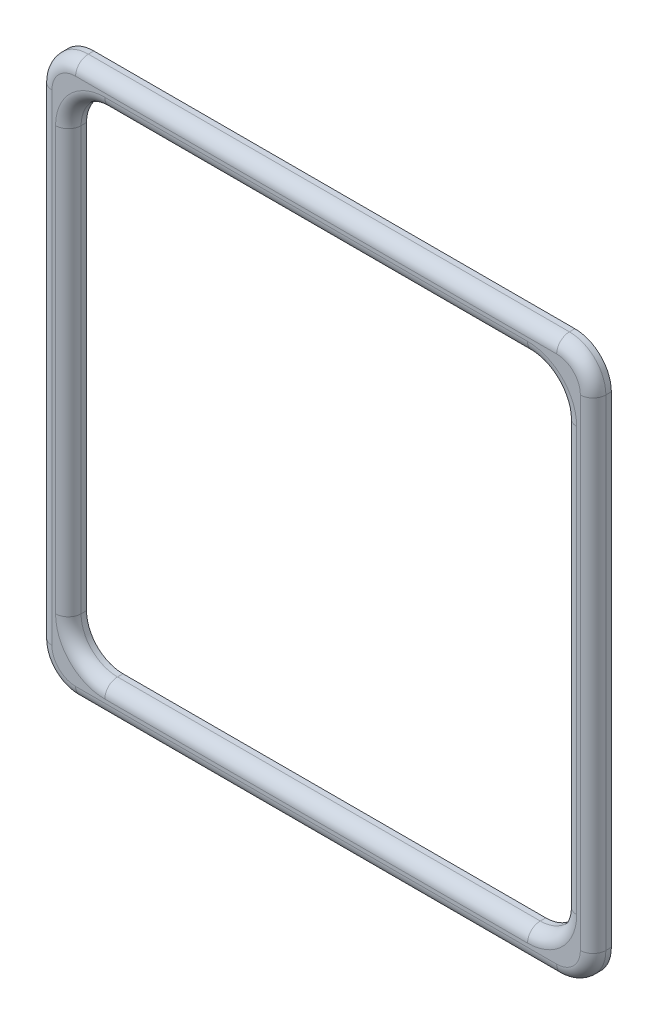
ISO-10303-21;
HEADER;
FILE_DESCRIPTION(('STEP AP214'),'2;1');
FILE_NAME('part.step','',(''),(''),'','','');
FILE_SCHEMA(('AUTOMOTIVE_DESIGN { 1 0 10303 214 1 1 1 1 }'));
ENDSEC;
DATA;
#1=APPLICATION_CONTEXT('core data for automotive mechanical design processes');
#2=APPLICATION_PROTOCOL_DEFINITION('international standard','automotive_design',2000,#1);
#3=PRODUCT_CONTEXT('',#1,'mechanical');
#4=PRODUCT('Part','Part','',(#3));
#5=PRODUCT_RELATED_PRODUCT_CATEGORY('part','',(#4));
#6=PRODUCT_DEFINITION_FORMATION('','',#4);
#7=PRODUCT_DEFINITION_CONTEXT('part definition',#1,'design');
#8=PRODUCT_DEFINITION('design','',#6,#7);
#9=PRODUCT_DEFINITION_SHAPE('','',#8);
#10=(LENGTH_UNIT() NAMED_UNIT(*) SI_UNIT(.MILLI.,.METRE.));
#11=(NAMED_UNIT(*) PLANE_ANGLE_UNIT() SI_UNIT($,.RADIAN.));
#12=(NAMED_UNIT(*) SI_UNIT($,.STERADIAN.) SOLID_ANGLE_UNIT());
#13=UNCERTAINTY_MEASURE_WITH_UNIT(LENGTH_MEASURE(1.E-05),#10,'distance_accuracy_value','');
#14=(GEOMETRIC_REPRESENTATION_CONTEXT(3) GLOBAL_UNCERTAINTY_ASSIGNED_CONTEXT((#13)) GLOBAL_UNIT_ASSIGNED_CONTEXT((#10,
#11,#12)) REPRESENTATION_CONTEXT('',''));
#15=CARTESIAN_POINT('',(0.,0.,0.));
#16=DIRECTION('',(0.,0.,1.));
#17=DIRECTION('',(1.,0.,0.));
#18=AXIS2_PLACEMENT_3D('',#15,#16,#17);
#19=CARTESIAN_POINT('',(-33.,-33.,2.5));
#20=DIRECTION('',(0.,0.,1.));
#21=DIRECTION('',(1.,0.,0.));
#22=AXIS2_PLACEMENT_3D('',#19,#20,#21);
#23=PLANE('',#22);
#24=DIRECTION('',(0.,-1.,0.));
#25=VECTOR('',#24,1.);
#26=CARTESIAN_POINT('',(-35.75,-33.,2.5));
#27=LINE('',#26,#25);
#28=CARTESIAN_POINT('',(-35.75,-29.,2.5));
#29=VERTEX_POINT('',#28);
#30=CARTESIAN_POINT('',(-35.75,29.,2.5));
#31=VERTEX_POINT('',#30);
#32=EDGE_CURVE('E316',#29,#31,#27,.F.);
#33=ORIENTED_EDGE('',*,*,#32,.T.);
#34=CARTESIAN_POINT('',(-29.,29.,2.5));
#35=DIRECTION('',(0.,0.,1.));
#36=DIRECTION('',(1.,0.,0.));
#37=AXIS2_PLACEMENT_3D('',#34,#35,#36);
#38=CIRCLE('',#37,6.75);
#39=CARTESIAN_POINT('',(-29.,35.75,2.5));
#40=VERTEX_POINT('',#39);
#41=EDGE_CURVE('E330',#31,#40,#38,.F.);
#42=ORIENTED_EDGE('',*,*,#41,.T.);
#43=DIRECTION('',(-1.,0.,0.));
#44=VECTOR('',#43,1.);
#45=CARTESIAN_POINT('',(-33.,35.75,2.5));
#46=LINE('',#45,#44);
#47=CARTESIAN_POINT('',(29.,35.75,2.5));
#48=VERTEX_POINT('',#47);
#49=EDGE_CURVE('E328',#40,#48,#46,.F.);
#50=ORIENTED_EDGE('',*,*,#49,.T.);
#51=CARTESIAN_POINT('',(29.,29.,2.5));
#52=DIRECTION('',(0.,0.,1.));
#53=DIRECTION('',(1.,0.,0.));
#54=AXIS2_PLACEMENT_3D('',#51,#52,#53);
#55=CIRCLE('',#54,6.75);
#56=CARTESIAN_POINT('',(35.75,29.,2.5));
#57=VERTEX_POINT('',#56);
#58=EDGE_CURVE('E326',#48,#57,#55,.F.);
#59=ORIENTED_EDGE('',*,*,#58,.T.);
#60=DIRECTION('',(0.,1.,0.));
#61=VECTOR('',#60,1.);
#62=CARTESIAN_POINT('',(35.75,-33.,2.5));
#63=LINE('',#62,#61);
#64=CARTESIAN_POINT('',(35.75,-29.,2.5));
#65=VERTEX_POINT('',#64);
#66=EDGE_CURVE('E324',#57,#65,#63,.F.);
#67=ORIENTED_EDGE('',*,*,#66,.T.);
#68=CARTESIAN_POINT('',(29.,-29.,2.5));
#69=DIRECTION('',(0.,0.,1.));
#70=DIRECTION('',(1.,0.,0.));
#71=AXIS2_PLACEMENT_3D('',#68,#69,#70);
#72=CIRCLE('',#71,6.75);
#73=CARTESIAN_POINT('',(29.,-35.75,2.5));
#74=VERTEX_POINT('',#73);
#75=EDGE_CURVE('E322',#65,#74,#72,.F.);
#76=ORIENTED_EDGE('',*,*,#75,.T.);
#77=DIRECTION('',(1.,0.,0.));
#78=VECTOR('',#77,1.);
#79=CARTESIAN_POINT('',(-33.,-35.75,2.5));
#80=LINE('',#79,#78);
#81=CARTESIAN_POINT('',(-29.,-35.75,2.5));
#82=VERTEX_POINT('',#81);
#83=EDGE_CURVE('E320',#74,#82,#80,.F.);
#84=ORIENTED_EDGE('',*,*,#83,.T.);
#85=CARTESIAN_POINT('',(-29.,-29.,2.5));
#86=DIRECTION('',(0.,0.,1.));
#87=DIRECTION('',(1.,0.,0.));
#88=AXIS2_PLACEMENT_3D('',#85,#86,#87);
#89=CIRCLE('',#88,6.75);
#90=EDGE_CURVE('E318',#82,#29,#89,.F.);
#91=ORIENTED_EDGE('',*,*,#90,.T.);
#92=EDGE_LOOP('',(#33,#42,#50,#59,#67,#76,#84,#91));
#93=FACE_BOUND('',#92,.T.);
#94=DIRECTION('',(-1.,0.,0.));
#95=VECTOR('',#94,1.);
#96=CARTESIAN_POINT('',(-33.,36.25,2.5));
#97=LINE('',#96,#95);
#98=CARTESIAN_POINT('',(33.,36.25,2.5));
#99=VERTEX_POINT('',#98);
#100=CARTESIAN_POINT('',(-33.,36.25,2.5));
#101=VERTEX_POINT('',#100);
#102=EDGE_CURVE('E311',#99,#101,#97,.T.);
#103=ORIENTED_EDGE('',*,*,#102,.T.);
#104=CARTESIAN_POINT('',(-33.,33.,2.5));
#105=DIRECTION('',(0.,0.,1.));
#106=DIRECTION('',(1.,0.,0.));
#107=AXIS2_PLACEMENT_3D('',#104,#105,#106);
#108=CIRCLE('',#107,3.25);
#109=CARTESIAN_POINT('',(-36.25,33.,2.5));
#110=VERTEX_POINT('',#109);
#111=EDGE_CURVE('E313',#101,#110,#108,.T.);
#112=ORIENTED_EDGE('',*,*,#111,.T.);
#113=DIRECTION('',(0.,-1.,0.));
#114=VECTOR('',#113,1.);
#115=CARTESIAN_POINT('',(-36.25,-33.,2.5));
#116=LINE('',#115,#114);
#117=CARTESIAN_POINT('',(-36.25,-33.,2.5));
#118=VERTEX_POINT('',#117);
#119=EDGE_CURVE('E299',#110,#118,#116,.T.);
#120=ORIENTED_EDGE('',*,*,#119,.T.);
#121=CARTESIAN_POINT('',(-33.,-33.,2.5));
#122=DIRECTION('',(0.,0.,1.));
#123=DIRECTION('',(1.,0.,0.));
#124=AXIS2_PLACEMENT_3D('',#121,#122,#123);
#125=CIRCLE('',#124,3.25);
#126=CARTESIAN_POINT('',(-33.,-36.25,2.5));
#127=VERTEX_POINT('',#126);
#128=EDGE_CURVE('E301',#118,#127,#125,.T.);
#129=ORIENTED_EDGE('',*,*,#128,.T.);
#130=DIRECTION('',(1.,0.,0.));
#131=VECTOR('',#130,1.);
#132=CARTESIAN_POINT('',(33.,-36.25,2.5));
#133=LINE('',#132,#131);
#134=CARTESIAN_POINT('',(33.,-36.25,2.5));
#135=VERTEX_POINT('',#134);
#136=EDGE_CURVE('E303',#127,#135,#133,.T.);
#137=ORIENTED_EDGE('',*,*,#136,.T.);
#138=CARTESIAN_POINT('',(33.,-33.,2.5));
#139=DIRECTION('',(0.,0.,1.));
#140=DIRECTION('',(1.,0.,0.));
#141=AXIS2_PLACEMENT_3D('',#138,#139,#140);
#142=CIRCLE('',#141,3.25);
#143=CARTESIAN_POINT('',(36.25,-33.,2.5));
#144=VERTEX_POINT('',#143);
#145=EDGE_CURVE('E305',#135,#144,#142,.T.);
#146=ORIENTED_EDGE('',*,*,#145,.T.);
#147=DIRECTION('',(0.,1.,0.));
#148=VECTOR('',#147,1.);
#149=CARTESIAN_POINT('',(36.25,33.,2.5));
#150=LINE('',#149,#148);
#151=CARTESIAN_POINT('',(36.25,33.,2.5));
#152=VERTEX_POINT('',#151);
#153=EDGE_CURVE('E307',#144,#152,#150,.T.);
#154=ORIENTED_EDGE('',*,*,#153,.T.);
#155=CARTESIAN_POINT('',(33.,33.,2.5));
#156=DIRECTION('',(0.,0.,1.));
#157=DIRECTION('',(1.,0.,0.));
#158=AXIS2_PLACEMENT_3D('',#155,#156,#157);
#159=CIRCLE('',#158,3.25);
#160=EDGE_CURVE('E309',#152,#99,#159,.T.);
#161=ORIENTED_EDGE('',*,*,#160,.T.);
#162=EDGE_LOOP('',(#103,#112,#120,#129,#137,#146,#154,#161));
#163=FACE_BOUND('',#162,.T.);
#164=ADVANCED_FACE('F35',(#93,#163),#23,.T.);
#165=CARTESIAN_POINT('',(-33.,-33.,0.));
#166=DIRECTION('',(0.,0.,1.));
#167=DIRECTION('',(1.,0.,0.));
#168=AXIS2_PLACEMENT_3D('',#165,#166,#167);
#169=PLANE('',#168);
#170=CARTESIAN_POINT('',(-33.,-33.,0.));
#171=DIRECTION('',(0.,0.,1.));
#172=DIRECTION('',(1.,0.,0.));
#173=AXIS2_PLACEMENT_3D('',#170,#171,#172);
#174=CIRCLE('',#173,5.);
#175=CARTESIAN_POINT('',(-38.,-33.,0.));
#176=VERTEX_POINT('',#175);
#177=CARTESIAN_POINT('',(-33.,-38.,0.));
#178=VERTEX_POINT('',#177);
#179=EDGE_CURVE('E209',#176,#178,#174,.T.);
#180=ORIENTED_EDGE('',*,*,#179,.F.);
#181=DIRECTION('',(0.,-1.,0.));
#182=VECTOR('',#181,1.);
#183=CARTESIAN_POINT('',(-38.,33.,0.));
#184=LINE('',#183,#182);
#185=CARTESIAN_POINT('',(-38.,33.,0.));
#186=VERTEX_POINT('',#185);
#187=EDGE_CURVE('E277',#186,#176,#184,.T.);
#188=ORIENTED_EDGE('',*,*,#187,.F.);
#189=CARTESIAN_POINT('',(-33.,33.,0.));
#190=DIRECTION('',(0.,0.,1.));
#191=DIRECTION('',(1.,0.,0.));
#192=AXIS2_PLACEMENT_3D('',#189,#190,#191);
#193=CIRCLE('',#192,5.);
#194=CARTESIAN_POINT('',(-33.,38.,0.));
#195=VERTEX_POINT('',#194);
#196=EDGE_CURVE('E274',#195,#186,#193,.T.);
#197=ORIENTED_EDGE('',*,*,#196,.F.);
#198=DIRECTION('',(-1.,0.,0.));
#199=VECTOR('',#198,1.);
#200=CARTESIAN_POINT('',(-33.,38.,0.));
#201=LINE('',#200,#199);
#202=CARTESIAN_POINT('',(33.,38.,0.));
#203=VERTEX_POINT('',#202);
#204=EDGE_CURVE('E271',#203,#195,#201,.T.);
#205=ORIENTED_EDGE('',*,*,#204,.F.);
#206=CARTESIAN_POINT('',(33.,33.,0.));
#207=DIRECTION('',(0.,0.,1.));
#208=DIRECTION('',(-1.,0.,0.));
#209=AXIS2_PLACEMENT_3D('',#206,#207,#208);
#210=CIRCLE('',#209,5.);
#211=CARTESIAN_POINT('',(38.,33.,0.));
#212=VERTEX_POINT('',#211);
#213=EDGE_CURVE('E268',#212,#203,#210,.T.);
#214=ORIENTED_EDGE('',*,*,#213,.F.);
#215=DIRECTION('',(0.,1.,0.));
#216=VECTOR('',#215,1.);
#217=CARTESIAN_POINT('',(38.,33.,0.));
#218=LINE('',#217,#216);
#219=CARTESIAN_POINT('',(38.,-33.,0.));
#220=VERTEX_POINT('',#219);
#221=EDGE_CURVE('E265',#220,#212,#218,.T.);
#222=ORIENTED_EDGE('',*,*,#221,.F.);
#223=CARTESIAN_POINT('',(33.,-33.,0.));
#224=DIRECTION('',(0.,0.,1.));
#225=DIRECTION('',(1.,0.,0.));
#226=AXIS2_PLACEMENT_3D('',#223,#224,#225);
#227=CIRCLE('',#226,5.);
#228=CARTESIAN_POINT('',(33.,-38.,0.));
#229=VERTEX_POINT('',#228);
#230=EDGE_CURVE('E262',#229,#220,#227,.T.);
#231=ORIENTED_EDGE('',*,*,#230,.F.);
#232=DIRECTION('',(1.,0.,0.));
#233=VECTOR('',#232,1.);
#234=CARTESIAN_POINT('',(-33.,-38.,0.));
#235=LINE('',#234,#233);
#236=EDGE_CURVE('E259',#178,#229,#235,.T.);
#237=ORIENTED_EDGE('',*,*,#236,.F.);
#238=EDGE_LOOP('',(#180,#188,#197,#205,#214,#222,#231,#237));
#239=FACE_BOUND('',#238,.T.);
#240=CARTESIAN_POINT('',(-29.,-29.,0.));
#241=DIRECTION('',(0.,0.,1.));
#242=DIRECTION('',(-1.,0.,0.));
#243=AXIS2_PLACEMENT_3D('',#240,#241,#242);
#244=CIRCLE('',#243,5.);
#245=CARTESIAN_POINT('',(-34.,-29.,0.));
#246=VERTEX_POINT('',#245);
#247=CARTESIAN_POINT('',(-29.,-34.,0.));
#248=VERTEX_POINT('',#247);
#249=EDGE_CURVE('E203',#246,#248,#244,.T.);
#250=ORIENTED_EDGE('',*,*,#249,.T.);
#251=DIRECTION('',(1.,0.,0.));
#252=VECTOR('',#251,1.);
#253=CARTESIAN_POINT('',(29.,-34.,0.));
#254=LINE('',#253,#252);
#255=CARTESIAN_POINT('',(29.,-34.,0.));
#256=VERTEX_POINT('',#255);
#257=EDGE_CURVE('E213',#248,#256,#254,.T.);
#258=ORIENTED_EDGE('',*,*,#257,.T.);
#259=CARTESIAN_POINT('',(29.,-29.,0.));
#260=DIRECTION('',(0.,0.,1.));
#261=DIRECTION('',(-1.,0.,0.));
#262=AXIS2_PLACEMENT_3D('',#259,#260,#261);
#263=CIRCLE('',#262,5.);
#264=CARTESIAN_POINT('',(34.,-29.,0.));
#265=VERTEX_POINT('',#264);
#266=EDGE_CURVE('E219',#256,#265,#263,.T.);
#267=ORIENTED_EDGE('',*,*,#266,.T.);
#268=DIRECTION('',(0.,1.,0.));
#269=VECTOR('',#268,1.);
#270=CARTESIAN_POINT('',(34.,29.,0.));
#271=LINE('',#270,#269);
#272=CARTESIAN_POINT('',(34.,29.,0.));
#273=VERTEX_POINT('',#272);
#274=EDGE_CURVE('E232',#265,#273,#271,.T.);
#275=ORIENTED_EDGE('',*,*,#274,.T.);
#276=CARTESIAN_POINT('',(29.,29.,0.));
#277=DIRECTION('',(0.,0.,1.));
#278=DIRECTION('',(-1.,0.,0.));
#279=AXIS2_PLACEMENT_3D('',#276,#277,#278);
#280=CIRCLE('',#279,5.);
#281=CARTESIAN_POINT('',(29.,34.,0.));
#282=VERTEX_POINT('',#281);
#283=EDGE_CURVE('E235',#273,#282,#280,.T.);
#284=ORIENTED_EDGE('',*,*,#283,.T.);
#285=DIRECTION('',(-1.,0.,0.));
#286=VECTOR('',#285,1.);
#287=CARTESIAN_POINT('',(29.,34.,0.));
#288=LINE('',#287,#286);
#289=CARTESIAN_POINT('',(-29.,34.,0.));
#290=VERTEX_POINT('',#289);
#291=EDGE_CURVE('E238',#282,#290,#288,.T.);
#292=ORIENTED_EDGE('',*,*,#291,.T.);
#293=CARTESIAN_POINT('',(-29.,29.,0.));
#294=DIRECTION('',(0.,0.,1.));
#295=DIRECTION('',(1.,0.,0.));
#296=AXIS2_PLACEMENT_3D('',#293,#294,#295);
#297=CIRCLE('',#296,5.);
#298=CARTESIAN_POINT('',(-34.,29.,0.));
#299=VERTEX_POINT('',#298);
#300=EDGE_CURVE('E241',#290,#299,#297,.T.);
#301=ORIENTED_EDGE('',*,*,#300,.T.);
#302=DIRECTION('',(0.,-1.,0.));
#303=VECTOR('',#302,1.);
#304=CARTESIAN_POINT('',(-34.,29.,0.));
#305=LINE('',#304,#303);
#306=EDGE_CURVE('E224',#299,#246,#305,.T.);
#307=ORIENTED_EDGE('',*,*,#306,.T.);
#308=EDGE_LOOP('',(#250,#258,#267,#275,#284,#292,#301,#307));
#309=FACE_BOUND('',#308,.T.);
#310=ADVANCED_FACE('F221',(#239,#309),#169,.F.);
#311=CARTESIAN_POINT('',(-33.,-33.,2.5));
#312=DIRECTION('',(0.,0.,-1.));
#313=DIRECTION('',(-1.,0.,0.));
#314=AXIS2_PLACEMENT_3D('',#311,#312,#313);
#315=CYLINDRICAL_SURFACE('',#314,5.);
#316=DIRECTION('',(0.,0.,-1.));
#317=VECTOR('',#316,1.);
#318=CARTESIAN_POINT('',(-33.,-38.,2.5));
#319=LINE('',#318,#317);
#320=CARTESIAN_POINT('',(-33.,-38.,0.75));
#321=VERTEX_POINT('',#320);
#322=EDGE_CURVE('E294',#321,#178,#319,.T.);
#323=ORIENTED_EDGE('',*,*,#322,.F.);
#324=CARTESIAN_POINT('',(-33.,-33.,0.75));
#325=DIRECTION('',(0.,0.,1.));
#326=DIRECTION('',(1.,0.,0.));
#327=AXIS2_PLACEMENT_3D('',#324,#325,#326);
#328=CIRCLE('',#327,5.);
#329=CARTESIAN_POINT('',(-38.,-33.,0.75));
#330=VERTEX_POINT('',#329);
#331=EDGE_CURVE('E52',#321,#330,#328,.F.);
#332=ORIENTED_EDGE('',*,*,#331,.T.);
#333=DIRECTION('',(0.,0.,-1.));
#334=VECTOR('',#333,1.);
#335=CARTESIAN_POINT('',(-38.,-33.,2.5));
#336=LINE('',#335,#334);
#337=EDGE_CURVE('E280',#330,#176,#336,.T.);
#338=ORIENTED_EDGE('',*,*,#337,.T.);
#339=ORIENTED_EDGE('',*,*,#179,.T.);
#340=EDGE_LOOP('',(#323,#332,#338,#339));
#341=FACE_BOUND('',#340,.T.);
#342=ADVANCED_FACE('F470',(#341),#315,.T.);
#343=CARTESIAN_POINT('',(-33.,-38.,2.5));
#344=DIRECTION('',(0.,1.,0.));
#345=DIRECTION('',(0.,0.,1.));
#346=AXIS2_PLACEMENT_3D('',#343,#344,#345);
#347=PLANE('',#346);
#348=DIRECTION('',(0.,0.,-1.));
#349=VECTOR('',#348,1.);
#350=CARTESIAN_POINT('',(33.,-38.,2.5));
#351=LINE('',#350,#349);
#352=CARTESIAN_POINT('',(33.,-38.,0.75));
#353=VERTEX_POINT('',#352);
#354=EDGE_CURVE('E292',#353,#229,#351,.T.);
#355=ORIENTED_EDGE('',*,*,#354,.F.);
#356=DIRECTION('',(1.,0.,0.));
#357=VECTOR('',#356,1.);
#358=CARTESIAN_POINT('',(-33.,-38.,0.75));
#359=LINE('',#358,#357);
#360=EDGE_CURVE('E60',#353,#321,#359,.F.);
#361=ORIENTED_EDGE('',*,*,#360,.T.);
#362=ORIENTED_EDGE('',*,*,#322,.T.);
#363=ORIENTED_EDGE('',*,*,#236,.T.);
#364=EDGE_LOOP('',(#355,#361,#362,#363));
#365=FACE_BOUND('',#364,.T.);
#366=ADVANCED_FACE('F409',(#365),#347,.F.);
#367=CARTESIAN_POINT('',(33.,-33.,2.5));
#368=DIRECTION('',(0.,0.,-1.));
#369=DIRECTION('',(-1.,0.,0.));
#370=AXIS2_PLACEMENT_3D('',#367,#368,#369);
#371=CYLINDRICAL_SURFACE('',#370,5.);
#372=DIRECTION('',(0.,0.,-1.));
#373=VECTOR('',#372,1.);
#374=CARTESIAN_POINT('',(38.,-33.,2.5));
#375=LINE('',#374,#373);
#376=CARTESIAN_POINT('',(38.,-33.,0.75));
#377=VERTEX_POINT('',#376);
#378=EDGE_CURVE('E290',#377,#220,#375,.T.);
#379=ORIENTED_EDGE('',*,*,#378,.F.);
#380=CARTESIAN_POINT('',(33.,-33.,0.75));
#381=DIRECTION('',(0.,0.,1.));
#382=DIRECTION('',(1.,0.,0.));
#383=AXIS2_PLACEMENT_3D('',#380,#381,#382);
#384=CIRCLE('',#383,5.);
#385=EDGE_CURVE('E353',#377,#353,#384,.F.);
#386=ORIENTED_EDGE('',*,*,#385,.T.);
#387=ORIENTED_EDGE('',*,*,#354,.T.);
#388=ORIENTED_EDGE('',*,*,#230,.T.);
#389=EDGE_LOOP('',(#379,#386,#387,#388));
#390=FACE_BOUND('',#389,.T.);
#391=ADVANCED_FACE('F408',(#390),#371,.T.);
#392=CARTESIAN_POINT('',(38.,33.,2.5));
#393=DIRECTION('',(-1.,0.,0.));
#394=DIRECTION('',(0.,-1.,0.));
#395=AXIS2_PLACEMENT_3D('',#392,#393,#394);
#396=PLANE('',#395);
#397=DIRECTION('',(0.,0.,-1.));
#398=VECTOR('',#397,1.);
#399=CARTESIAN_POINT('',(38.,33.,2.5));
#400=LINE('',#399,#398);
#401=CARTESIAN_POINT('',(38.,33.,0.75));
#402=VERTEX_POINT('',#401);
#403=EDGE_CURVE('E288',#402,#212,#400,.T.);
#404=ORIENTED_EDGE('',*,*,#403,.F.);
#405=DIRECTION('',(0.,1.,0.));
#406=VECTOR('',#405,1.);
#407=CARTESIAN_POINT('',(38.,-33.,0.75));
#408=LINE('',#407,#406);
#409=EDGE_CURVE('E351',#402,#377,#408,.F.);
#410=ORIENTED_EDGE('',*,*,#409,.T.);
#411=ORIENTED_EDGE('',*,*,#378,.T.);
#412=ORIENTED_EDGE('',*,*,#221,.T.);
#413=EDGE_LOOP('',(#404,#410,#411,#412));
#414=FACE_BOUND('',#413,.T.);
#415=ADVANCED_FACE('F419',(#414),#396,.F.);
#416=CARTESIAN_POINT('',(33.,33.,2.5));
#417=DIRECTION('',(0.,0.,-1.));
#418=DIRECTION('',(-1.,0.,0.));
#419=AXIS2_PLACEMENT_3D('',#416,#417,#418);
#420=CYLINDRICAL_SURFACE('',#419,5.);
#421=DIRECTION('',(0.,0.,-1.));
#422=VECTOR('',#421,1.);
#423=CARTESIAN_POINT('',(33.,38.,2.5));
#424=LINE('',#423,#422);
#425=CARTESIAN_POINT('',(33.,38.,0.75));
#426=VERTEX_POINT('',#425);
#427=EDGE_CURVE('E286',#426,#203,#424,.T.);
#428=ORIENTED_EDGE('',*,*,#427,.F.);
#429=CARTESIAN_POINT('',(33.,33.,0.75));
#430=DIRECTION('',(0.,0.,1.));
#431=DIRECTION('',(1.,0.,0.));
#432=AXIS2_PLACEMENT_3D('',#429,#430,#431);
#433=CIRCLE('',#432,5.);
#434=EDGE_CURVE('E349',#426,#402,#433,.F.);
#435=ORIENTED_EDGE('',*,*,#434,.T.);
#436=ORIENTED_EDGE('',*,*,#403,.T.);
#437=ORIENTED_EDGE('',*,*,#213,.T.);
#438=EDGE_LOOP('',(#428,#435,#436,#437));
#439=FACE_BOUND('',#438,.T.);
#440=ADVANCED_FACE('F422',(#439),#420,.T.);
#441=CARTESIAN_POINT('',(-33.,38.,2.5));
#442=DIRECTION('',(0.,-1.,0.));
#443=DIRECTION('',(0.,0.,-1.));
#444=AXIS2_PLACEMENT_3D('',#441,#442,#443);
#445=PLANE('',#444);
#446=DIRECTION('',(0.,0.,-1.));
#447=VECTOR('',#446,1.);
#448=CARTESIAN_POINT('',(-33.,38.,2.5));
#449=LINE('',#448,#447);
#450=CARTESIAN_POINT('',(-33.,38.,0.75));
#451=VERTEX_POINT('',#450);
#452=EDGE_CURVE('E284',#451,#195,#449,.T.);
#453=ORIENTED_EDGE('',*,*,#452,.F.);
#454=DIRECTION('',(-1.,0.,0.));
#455=VECTOR('',#454,1.);
#456=CARTESIAN_POINT('',(33.,38.,0.75));
#457=LINE('',#456,#455);
#458=EDGE_CURVE('E347',#451,#426,#457,.F.);
#459=ORIENTED_EDGE('',*,*,#458,.T.);
#460=ORIENTED_EDGE('',*,*,#427,.T.);
#461=ORIENTED_EDGE('',*,*,#204,.T.);
#462=EDGE_LOOP('',(#453,#459,#460,#461));
#463=FACE_BOUND('',#462,.T.);
#464=ADVANCED_FACE('F479',(#463),#445,.F.);
#465=CARTESIAN_POINT('',(-33.,33.,2.5));
#466=DIRECTION('',(0.,0.,-1.));
#467=DIRECTION('',(-1.,0.,0.));
#468=AXIS2_PLACEMENT_3D('',#465,#466,#467);
#469=CYLINDRICAL_SURFACE('',#468,5.);
#470=DIRECTION('',(0.,0.,-1.));
#471=VECTOR('',#470,1.);
#472=CARTESIAN_POINT('',(-38.,33.,2.5));
#473=LINE('',#472,#471);
#474=CARTESIAN_POINT('',(-38.,33.,0.75));
#475=VERTEX_POINT('',#474);
#476=EDGE_CURVE('E282',#475,#186,#473,.T.);
#477=ORIENTED_EDGE('',*,*,#476,.F.);
#478=CARTESIAN_POINT('',(-33.,33.,0.75));
#479=DIRECTION('',(0.,0.,1.));
#480=DIRECTION('',(1.,0.,0.));
#481=AXIS2_PLACEMENT_3D('',#478,#479,#480);
#482=CIRCLE('',#481,5.);
#483=EDGE_CURVE('E344',#475,#451,#482,.F.);
#484=ORIENTED_EDGE('',*,*,#483,.T.);
#485=ORIENTED_EDGE('',*,*,#452,.T.);
#486=ORIENTED_EDGE('',*,*,#196,.T.);
#487=EDGE_LOOP('',(#477,#484,#485,#486));
#488=FACE_BOUND('',#487,.T.);
#489=ADVANCED_FACE('F451',(#488),#469,.T.);
#490=CARTESIAN_POINT('',(-38.,33.,2.5));
#491=DIRECTION('',(1.,0.,0.));
#492=DIRECTION('',(0.,1.,0.));
#493=AXIS2_PLACEMENT_3D('',#490,#491,#492);
#494=PLANE('',#493);
#495=ORIENTED_EDGE('',*,*,#337,.F.);
#496=DIRECTION('',(0.,-1.,0.));
#497=VECTOR('',#496,1.);
#498=CARTESIAN_POINT('',(-38.,33.,0.75));
#499=LINE('',#498,#497);
#500=EDGE_CURVE('E11',#330,#475,#499,.F.);
#501=ORIENTED_EDGE('',*,*,#500,.T.);
#502=ORIENTED_EDGE('',*,*,#476,.T.);
#503=ORIENTED_EDGE('',*,*,#187,.T.);
#504=EDGE_LOOP('',(#495,#501,#502,#503));
#505=FACE_BOUND('',#504,.T.);
#506=ADVANCED_FACE('F448',(#505),#494,.F.);
#507=CARTESIAN_POINT('',(-29.,-29.,2.5));
#508=DIRECTION('',(0.,0.,-1.));
#509=DIRECTION('',(-1.,0.,0.));
#510=AXIS2_PLACEMENT_3D('',#507,#508,#509);
#511=CYLINDRICAL_SURFACE('',#510,5.);
#512=DIRECTION('',(0.,0.,-1.));
#513=VECTOR('',#512,1.);
#514=CARTESIAN_POINT('',(-34.,-29.,2.5));
#515=LINE('',#514,#513);
#516=CARTESIAN_POINT('',(-34.,-29.,0.75));
#517=VERTEX_POINT('',#516);
#518=EDGE_CURVE('E244',#517,#246,#515,.T.);
#519=ORIENTED_EDGE('',*,*,#518,.F.);
#520=CARTESIAN_POINT('',(-29.,-29.,0.75));
#521=DIRECTION('',(0.,0.,1.));
#522=DIRECTION('',(1.,0.,0.));
#523=AXIS2_PLACEMENT_3D('',#520,#521,#522);
#524=CIRCLE('',#523,5.);
#525=CARTESIAN_POINT('',(-29.,-34.,0.75));
#526=VERTEX_POINT('',#525);
#527=EDGE_CURVE('E206',#517,#526,#524,.T.);
#528=ORIENTED_EDGE('',*,*,#527,.T.);
#529=DIRECTION('',(0.,0.,-1.));
#530=VECTOR('',#529,1.);
#531=CARTESIAN_POINT('',(-29.,-34.,2.5));
#532=LINE('',#531,#530);
#533=EDGE_CURVE('E198',#526,#248,#532,.T.);
#534=ORIENTED_EDGE('',*,*,#533,.T.);
#535=ORIENTED_EDGE('',*,*,#249,.F.);
#536=EDGE_LOOP('',(#519,#528,#534,#535));
#537=FACE_BOUND('',#536,.T.);
#538=ADVANCED_FACE('F201',(#537),#511,.F.);
#539=CARTESIAN_POINT('',(29.,-34.,2.5));
#540=DIRECTION('',(0.,1.,0.));
#541=DIRECTION('',(-1.,0.,0.));
#542=AXIS2_PLACEMENT_3D('',#539,#540,#541);
#543=PLANE('',#542);
#544=ORIENTED_EDGE('',*,*,#533,.F.);
#545=DIRECTION('',(1.,0.,0.));
#546=VECTOR('',#545,1.);
#547=CARTESIAN_POINT('',(29.,-34.,0.75));
#548=LINE('',#547,#546);
#549=CARTESIAN_POINT('',(29.,-34.,0.75));
#550=VERTEX_POINT('',#549);
#551=EDGE_CURVE('E341',#526,#550,#548,.T.);
#552=ORIENTED_EDGE('',*,*,#551,.T.);
#553=DIRECTION('',(0.,0.,-1.));
#554=VECTOR('',#553,1.);
#555=CARTESIAN_POINT('',(29.,-34.,2.5));
#556=LINE('',#555,#554);
#557=EDGE_CURVE('E210',#550,#256,#556,.T.);
#558=ORIENTED_EDGE('',*,*,#557,.T.);
#559=ORIENTED_EDGE('',*,*,#257,.F.);
#560=EDGE_LOOP('',(#544,#552,#558,#559));
#561=FACE_BOUND('',#560,.T.);
#562=ADVANCED_FACE('F214',(#561),#543,.T.);
#563=CARTESIAN_POINT('',(29.,-29.,2.5));
#564=DIRECTION('',(0.,0.,-1.));
#565=DIRECTION('',(-1.,0.,0.));
#566=AXIS2_PLACEMENT_3D('',#563,#564,#565);
#567=CYLINDRICAL_SURFACE('',#566,5.);
#568=ORIENTED_EDGE('',*,*,#557,.F.);
#569=CARTESIAN_POINT('',(29.,-29.,0.75));
#570=DIRECTION('',(0.,0.,1.));
#571=DIRECTION('',(1.,0.,0.));
#572=AXIS2_PLACEMENT_3D('',#569,#570,#571);
#573=CIRCLE('',#572,5.);
#574=CARTESIAN_POINT('',(34.,-29.,0.75));
#575=VERTEX_POINT('',#574);
#576=EDGE_CURVE('E339',#550,#575,#573,.T.);
#577=ORIENTED_EDGE('',*,*,#576,.T.);
#578=DIRECTION('',(0.,0.,-1.));
#579=VECTOR('',#578,1.);
#580=CARTESIAN_POINT('',(34.,-29.,2.5));
#581=LINE('',#580,#579);
#582=EDGE_CURVE('E254',#575,#265,#581,.T.);
#583=ORIENTED_EDGE('',*,*,#582,.T.);
#584=ORIENTED_EDGE('',*,*,#266,.F.);
#585=EDGE_LOOP('',(#568,#577,#583,#584));
#586=FACE_BOUND('',#585,.T.);
#587=ADVANCED_FACE('F560',(#586),#567,.F.);
#588=CARTESIAN_POINT('',(34.,29.,2.5));
#589=DIRECTION('',(-1.,0.,0.));
#590=DIRECTION('',(0.,-1.,0.));
#591=AXIS2_PLACEMENT_3D('',#588,#589,#590);
#592=PLANE('',#591);
#593=ORIENTED_EDGE('',*,*,#582,.F.);
#594=DIRECTION('',(0.,1.,0.));
#595=VECTOR('',#594,1.);
#596=CARTESIAN_POINT('',(34.,29.,0.75));
#597=LINE('',#596,#595);
#598=CARTESIAN_POINT('',(34.,29.,0.75));
#599=VERTEX_POINT('',#598);
#600=EDGE_CURVE('E337',#575,#599,#597,.T.);
#601=ORIENTED_EDGE('',*,*,#600,.T.);
#602=DIRECTION('',(0.,0.,-1.));
#603=VECTOR('',#602,1.);
#604=CARTESIAN_POINT('',(34.,29.,2.5));
#605=LINE('',#604,#603);
#606=EDGE_CURVE('E252',#599,#273,#605,.T.);
#607=ORIENTED_EDGE('',*,*,#606,.T.);
#608=ORIENTED_EDGE('',*,*,#274,.F.);
#609=EDGE_LOOP('',(#593,#601,#607,#608));
#610=FACE_BOUND('',#609,.T.);
#611=ADVANCED_FACE('F558',(#610),#592,.T.);
#612=CARTESIAN_POINT('',(29.,29.,2.5));
#613=DIRECTION('',(0.,0.,-1.));
#614=DIRECTION('',(-1.,0.,0.));
#615=AXIS2_PLACEMENT_3D('',#612,#613,#614);
#616=CYLINDRICAL_SURFACE('',#615,5.);
#617=ORIENTED_EDGE('',*,*,#606,.F.);
#618=CARTESIAN_POINT('',(29.,29.,0.75));
#619=DIRECTION('',(0.,0.,1.));
#620=DIRECTION('',(1.,0.,0.));
#621=AXIS2_PLACEMENT_3D('',#618,#619,#620);
#622=CIRCLE('',#621,5.);
#623=CARTESIAN_POINT('',(29.,34.,0.75));
#624=VERTEX_POINT('',#623);
#625=EDGE_CURVE('E335',#599,#624,#622,.T.);
#626=ORIENTED_EDGE('',*,*,#625,.T.);
#627=DIRECTION('',(0.,0.,-1.));
#628=VECTOR('',#627,1.);
#629=CARTESIAN_POINT('',(29.,34.,2.5));
#630=LINE('',#629,#628);
#631=EDGE_CURVE('E250',#624,#282,#630,.T.);
#632=ORIENTED_EDGE('',*,*,#631,.T.);
#633=ORIENTED_EDGE('',*,*,#283,.F.);
#634=EDGE_LOOP('',(#617,#626,#632,#633));
#635=FACE_BOUND('',#634,.T.);
#636=ADVANCED_FACE('F548',(#635),#616,.F.);
#637=CARTESIAN_POINT('',(29.,34.,2.5));
#638=DIRECTION('',(0.,-1.,0.));
#639=DIRECTION('',(1.,0.,0.));
#640=AXIS2_PLACEMENT_3D('',#637,#638,#639);
#641=PLANE('',#640);
#642=ORIENTED_EDGE('',*,*,#631,.F.);
#643=DIRECTION('',(-1.,0.,0.));
#644=VECTOR('',#643,1.);
#645=CARTESIAN_POINT('',(29.,34.,0.75));
#646=LINE('',#645,#644);
#647=CARTESIAN_POINT('',(-29.,34.,0.75));
#648=VERTEX_POINT('',#647);
#649=EDGE_CURVE('E333',#624,#648,#646,.T.);
#650=ORIENTED_EDGE('',*,*,#649,.T.);
#651=DIRECTION('',(0.,0.,-1.));
#652=VECTOR('',#651,1.);
#653=CARTESIAN_POINT('',(-29.,34.,2.5));
#654=LINE('',#653,#652);
#655=EDGE_CURVE('E248',#648,#290,#654,.T.);
#656=ORIENTED_EDGE('',*,*,#655,.T.);
#657=ORIENTED_EDGE('',*,*,#291,.F.);
#658=EDGE_LOOP('',(#642,#650,#656,#657));
#659=FACE_BOUND('',#658,.T.);
#660=ADVANCED_FACE('F552',(#659),#641,.T.);
#661=CARTESIAN_POINT('',(-29.,29.,2.5));
#662=DIRECTION('',(0.,0.,-1.));
#663=DIRECTION('',(-1.,0.,0.));
#664=AXIS2_PLACEMENT_3D('',#661,#662,#663);
#665=CYLINDRICAL_SURFACE('',#664,5.);
#666=ORIENTED_EDGE('',*,*,#655,.F.);
#667=CARTESIAN_POINT('',(-29.,29.,0.75));
#668=DIRECTION('',(0.,0.,1.));
#669=DIRECTION('',(1.,0.,0.));
#670=AXIS2_PLACEMENT_3D('',#667,#668,#669);
#671=CIRCLE('',#670,5.);
#672=CARTESIAN_POINT('',(-34.,29.,0.75));
#673=VERTEX_POINT('',#672);
#674=EDGE_CURVE('E296',#648,#673,#671,.T.);
#675=ORIENTED_EDGE('',*,*,#674,.T.);
#676=DIRECTION('',(0.,0.,-1.));
#677=VECTOR('',#676,1.);
#678=CARTESIAN_POINT('',(-34.,29.,2.5));
#679=LINE('',#678,#677);
#680=EDGE_CURVE('E246',#673,#299,#679,.T.);
#681=ORIENTED_EDGE('',*,*,#680,.T.);
#682=ORIENTED_EDGE('',*,*,#300,.F.);
#683=EDGE_LOOP('',(#666,#675,#681,#682));
#684=FACE_BOUND('',#683,.T.);
#685=ADVANCED_FACE('F527',(#684),#665,.F.);
#686=CARTESIAN_POINT('',(-34.,29.,2.5));
#687=DIRECTION('',(1.,0.,0.));
#688=DIRECTION('',(0.,0.,-1.));
#689=AXIS2_PLACEMENT_3D('',#686,#687,#688);
#690=PLANE('',#689);
#691=ORIENTED_EDGE('',*,*,#680,.F.);
#692=DIRECTION('',(0.,-1.,0.));
#693=VECTOR('',#692,1.);
#694=CARTESIAN_POINT('',(-34.,29.,0.75));
#695=LINE('',#694,#693);
#696=EDGE_CURVE('E44',#673,#517,#695,.T.);
#697=ORIENTED_EDGE('',*,*,#696,.T.);
#698=ORIENTED_EDGE('',*,*,#518,.T.);
#699=ORIENTED_EDGE('',*,*,#306,.F.);
#700=EDGE_LOOP('',(#691,#697,#698,#699));
#701=FACE_BOUND('',#700,.T.);
#702=ADVANCED_FACE('F522',(#701),#690,.T.);
#703=CARTESIAN_POINT('',(29.,-29.,0.75));
#704=DIRECTION('',(0.,0.,1.));
#705=DIRECTION('',(1.,0.,0.));
#706=AXIS2_PLACEMENT_3D('',#703,#704,#705);
#707=TOROIDAL_SURFACE('',#706,6.75,1.75);
#708=CARTESIAN_POINT('',(29.,-35.75,0.75));
#709=DIRECTION('',(-1.,0.,0.));
#710=DIRECTION('',(0.,-1.,0.));
#711=AXIS2_PLACEMENT_3D('',#708,#709,#710);
#712=CIRCLE('',#711,1.75);
#713=EDGE_CURVE('E228',#74,#550,#712,.T.);
#714=ORIENTED_EDGE('',*,*,#713,.F.);
#715=ORIENTED_EDGE('',*,*,#75,.F.);
#716=CARTESIAN_POINT('',(35.75,-28.9999999999999,0.75));
#717=DIRECTION('',(0.,1.,0.));
#718=DIRECTION('',(0.,0.,1.));
#719=AXIS2_PLACEMENT_3D('',#716,#717,#718);
#720=CIRCLE('',#719,1.75);
#721=EDGE_CURVE('E225',#575,#65,#720,.T.);
#722=ORIENTED_EDGE('',*,*,#721,.F.);
#723=ORIENTED_EDGE('',*,*,#576,.F.);
#724=EDGE_LOOP('',(#714,#715,#722,#723));
#725=FACE_BOUND('',#724,.T.);
#726=ADVANCED_FACE('F519',(#725),#707,.T.);
#727=CARTESIAN_POINT('',(35.75,29.,0.75));
#728=DIRECTION('',(0.,1.,0.));
#729=DIRECTION('',(-1.,0.,0.));
#730=AXIS2_PLACEMENT_3D('',#727,#728,#729);
#731=CYLINDRICAL_SURFACE('',#730,1.75);
#732=ORIENTED_EDGE('',*,*,#721,.T.);
#733=ORIENTED_EDGE('',*,*,#66,.F.);
#734=CARTESIAN_POINT('',(35.75,29.,0.75));
#735=DIRECTION('',(0.,1.,0.));
#736=DIRECTION('',(0.,0.,1.));
#737=AXIS2_PLACEMENT_3D('',#734,#735,#736);
#738=CIRCLE('',#737,1.75);
#739=EDGE_CURVE('E371',#599,#57,#738,.T.);
#740=ORIENTED_EDGE('',*,*,#739,.F.);
#741=ORIENTED_EDGE('',*,*,#600,.F.);
#742=EDGE_LOOP('',(#732,#733,#740,#741));
#743=FACE_BOUND('',#742,.T.);
#744=ADVANCED_FACE('F516',(#743),#731,.T.);
#745=CARTESIAN_POINT('',(29.,-35.75,0.75));
#746=DIRECTION('',(1.,0.,0.));
#747=DIRECTION('',(0.,1.,0.));
#748=AXIS2_PLACEMENT_3D('',#745,#746,#747);
#749=CYLINDRICAL_SURFACE('',#748,1.75);
#750=ORIENTED_EDGE('',*,*,#713,.T.);
#751=ORIENTED_EDGE('',*,*,#551,.F.);
#752=CARTESIAN_POINT('',(-29.,-35.75,0.75));
#753=DIRECTION('',(-1.,0.,0.));
#754=DIRECTION('',(0.,0.,1.));
#755=AXIS2_PLACEMENT_3D('',#752,#753,#754);
#756=CIRCLE('',#755,1.75);
#757=EDGE_CURVE('E368',#82,#526,#756,.T.);
#758=ORIENTED_EDGE('',*,*,#757,.F.);
#759=ORIENTED_EDGE('',*,*,#83,.F.);
#760=EDGE_LOOP('',(#750,#751,#758,#759));
#761=FACE_BOUND('',#760,.T.);
#762=ADVANCED_FACE('F512',(#761),#749,.T.);
#763=CARTESIAN_POINT('',(29.,29.,0.75));
#764=DIRECTION('',(0.,0.,1.));
#765=DIRECTION('',(1.,0.,0.));
#766=AXIS2_PLACEMENT_3D('',#763,#764,#765);
#767=TOROIDAL_SURFACE('',#766,6.75,1.75);
#768=ORIENTED_EDGE('',*,*,#739,.T.);
#769=ORIENTED_EDGE('',*,*,#58,.F.);
#770=CARTESIAN_POINT('',(29.,35.75,0.75));
#771=DIRECTION('',(-1.,0.,0.));
#772=DIRECTION('',(0.,0.,1.));
#773=AXIS2_PLACEMENT_3D('',#770,#771,#772);
#774=CIRCLE('',#773,1.75);
#775=EDGE_CURVE('E365',#624,#48,#774,.T.);
#776=ORIENTED_EDGE('',*,*,#775,.F.);
#777=ORIENTED_EDGE('',*,*,#625,.F.);
#778=EDGE_LOOP('',(#768,#769,#776,#777));
#779=FACE_BOUND('',#778,.T.);
#780=ADVANCED_FACE('F508',(#779),#767,.T.);
#781=CARTESIAN_POINT('',(-29.,-29.,0.75));
#782=DIRECTION('',(0.,0.,1.));
#783=DIRECTION('',(1.,0.,0.));
#784=AXIS2_PLACEMENT_3D('',#781,#782,#783);
#785=TOROIDAL_SURFACE('',#784,6.75,1.75);
#786=ORIENTED_EDGE('',*,*,#757,.T.);
#787=ORIENTED_EDGE('',*,*,#527,.F.);
#788=CARTESIAN_POINT('',(-35.75,-29.,0.75));
#789=DIRECTION('',(0.,1.,0.));
#790=DIRECTION('',(-1.,0.,0.));
#791=AXIS2_PLACEMENT_3D('',#788,#789,#790);
#792=CIRCLE('',#791,1.75);
#793=EDGE_CURVE('E362',#29,#517,#792,.T.);
#794=ORIENTED_EDGE('',*,*,#793,.F.);
#795=ORIENTED_EDGE('',*,*,#90,.F.);
#796=EDGE_LOOP('',(#786,#787,#794,#795));
#797=FACE_BOUND('',#796,.T.);
#798=ADVANCED_FACE('F504',(#797),#785,.T.);
#799=CARTESIAN_POINT('',(29.,35.75,0.75));
#800=DIRECTION('',(-1.,0.,0.));
#801=DIRECTION('',(0.,-1.,0.));
#802=AXIS2_PLACEMENT_3D('',#799,#800,#801);
#803=CYLINDRICAL_SURFACE('',#802,1.75);
#804=ORIENTED_EDGE('',*,*,#775,.T.);
#805=ORIENTED_EDGE('',*,*,#49,.F.);
#806=CARTESIAN_POINT('',(-29.,35.75,0.75));
#807=DIRECTION('',(-1.,0.,0.));
#808=DIRECTION('',(0.,0.,1.));
#809=AXIS2_PLACEMENT_3D('',#806,#807,#808);
#810=CIRCLE('',#809,1.75);
#811=EDGE_CURVE('E360',#648,#40,#810,.T.);
#812=ORIENTED_EDGE('',*,*,#811,.F.);
#813=ORIENTED_EDGE('',*,*,#649,.F.);
#814=EDGE_LOOP('',(#804,#805,#812,#813));
#815=FACE_BOUND('',#814,.T.);
#816=ADVANCED_FACE('F500',(#815),#803,.T.);
#817=CARTESIAN_POINT('',(-35.75,29.,0.75));
#818=DIRECTION('',(0.,-1.,0.));
#819=DIRECTION('',(0.,0.,-1.));
#820=AXIS2_PLACEMENT_3D('',#817,#818,#819);
#821=CYLINDRICAL_SURFACE('',#820,1.75);
#822=ORIENTED_EDGE('',*,*,#793,.T.);
#823=ORIENTED_EDGE('',*,*,#696,.F.);
#824=CARTESIAN_POINT('',(-35.75,29.,0.75));
#825=DIRECTION('',(0.,1.,0.));
#826=DIRECTION('',(-1.,0.,0.));
#827=AXIS2_PLACEMENT_3D('',#824,#825,#826);
#828=CIRCLE('',#827,1.75);
#829=EDGE_CURVE('E358',#31,#673,#828,.T.);
#830=ORIENTED_EDGE('',*,*,#829,.F.);
#831=ORIENTED_EDGE('',*,*,#32,.F.);
#832=EDGE_LOOP('',(#822,#823,#830,#831));
#833=FACE_BOUND('',#832,.T.);
#834=ADVANCED_FACE('F496',(#833),#821,.T.);
#835=CARTESIAN_POINT('',(-29.,29.,0.75));
#836=DIRECTION('',(0.,0.,1.));
#837=DIRECTION('',(1.,0.,0.));
#838=AXIS2_PLACEMENT_3D('',#835,#836,#837);
#839=TOROIDAL_SURFACE('',#838,6.75,1.75);
#840=ORIENTED_EDGE('',*,*,#811,.T.);
#841=ORIENTED_EDGE('',*,*,#41,.F.);
#842=ORIENTED_EDGE('',*,*,#829,.T.);
#843=ORIENTED_EDGE('',*,*,#674,.F.);
#844=EDGE_LOOP('',(#840,#841,#842,#843));
#845=FACE_BOUND('',#844,.T.);
#846=ADVANCED_FACE('F493',(#845),#839,.T.);
#847=CARTESIAN_POINT('',(33.,-33.,0.75));
#848=DIRECTION('',(0.,0.,1.));
#849=DIRECTION('',(1.,0.,0.));
#850=AXIS2_PLACEMENT_3D('',#847,#848,#849);
#851=TOROIDAL_SURFACE('',#850,3.25,1.75);
#852=CARTESIAN_POINT('',(33.,-36.25,0.75));
#853=DIRECTION('',(-1.,0.,0.));
#854=DIRECTION('',(0.,-1.,0.));
#855=AXIS2_PLACEMENT_3D('',#852,#853,#854);
#856=CIRCLE('',#855,1.75);
#857=EDGE_CURVE('E391',#353,#135,#856,.T.);
#858=ORIENTED_EDGE('',*,*,#857,.F.);
#859=ORIENTED_EDGE('',*,*,#385,.F.);
#860=CARTESIAN_POINT('',(36.25,-33.,0.75));
#861=DIRECTION('',(0.,1.,0.));
#862=DIRECTION('',(0.,0.,1.));
#863=AXIS2_PLACEMENT_3D('',#860,#861,#862);
#864=CIRCLE('',#863,1.75);
#865=EDGE_CURVE('E39',#144,#377,#864,.T.);
#866=ORIENTED_EDGE('',*,*,#865,.F.);
#867=ORIENTED_EDGE('',*,*,#145,.F.);
#868=EDGE_LOOP('',(#858,#859,#866,#867));
#869=FACE_BOUND('',#868,.T.);
#870=ADVANCED_FACE('F37',(#869),#851,.T.);
#871=CARTESIAN_POINT('',(36.25,-33.,0.75));
#872=DIRECTION('',(0.,-1.,0.));
#873=DIRECTION('',(1.,0.,0.));
#874=AXIS2_PLACEMENT_3D('',#871,#872,#873);
#875=CYLINDRICAL_SURFACE('',#874,1.75);
#876=ORIENTED_EDGE('',*,*,#865,.T.);
#877=ORIENTED_EDGE('',*,*,#409,.F.);
#878=CARTESIAN_POINT('',(36.25,33.,0.75));
#879=DIRECTION('',(0.,1.,0.));
#880=DIRECTION('',(-1.,0.,0.));
#881=AXIS2_PLACEMENT_3D('',#878,#879,#880);
#882=CIRCLE('',#881,1.75);
#883=EDGE_CURVE('E389',#152,#402,#882,.T.);
#884=ORIENTED_EDGE('',*,*,#883,.F.);
#885=ORIENTED_EDGE('',*,*,#153,.F.);
#886=EDGE_LOOP('',(#876,#877,#884,#885));
#887=FACE_BOUND('',#886,.T.);
#888=ADVANCED_FACE('F401',(#887),#875,.T.);
#889=CARTESIAN_POINT('',(-33.,-36.25,0.75));
#890=DIRECTION('',(-1.,0.,0.));
#891=DIRECTION('',(0.,0.,1.));
#892=AXIS2_PLACEMENT_3D('',#889,#890,#891);
#893=CYLINDRICAL_SURFACE('',#892,1.75);
#894=ORIENTED_EDGE('',*,*,#857,.T.);
#895=ORIENTED_EDGE('',*,*,#136,.F.);
#896=CARTESIAN_POINT('',(-33.,-36.25,0.75));
#897=DIRECTION('',(-1.,0.,0.));
#898=DIRECTION('',(0.,0.,1.));
#899=AXIS2_PLACEMENT_3D('',#896,#897,#898);
#900=CIRCLE('',#899,1.75);
#901=EDGE_CURVE('E386',#321,#127,#900,.T.);
#902=ORIENTED_EDGE('',*,*,#901,.F.);
#903=ORIENTED_EDGE('',*,*,#360,.F.);
#904=EDGE_LOOP('',(#894,#895,#902,#903));
#905=FACE_BOUND('',#904,.T.);
#906=ADVANCED_FACE('F437',(#905),#893,.T.);
#907=CARTESIAN_POINT('',(33.,33.,0.75));
#908=DIRECTION('',(0.,0.,1.));
#909=DIRECTION('',(1.,0.,0.));
#910=AXIS2_PLACEMENT_3D('',#907,#908,#909);
#911=TOROIDAL_SURFACE('',#910,3.25,1.75);
#912=ORIENTED_EDGE('',*,*,#883,.T.);
#913=ORIENTED_EDGE('',*,*,#434,.F.);
#914=CARTESIAN_POINT('',(33.,36.25,0.75));
#915=DIRECTION('',(-1.,0.,0.));
#916=DIRECTION('',(0.,0.,1.));
#917=AXIS2_PLACEMENT_3D('',#914,#915,#916);
#918=CIRCLE('',#917,1.75);
#919=EDGE_CURVE('E383',#99,#426,#918,.T.);
#920=ORIENTED_EDGE('',*,*,#919,.F.);
#921=ORIENTED_EDGE('',*,*,#160,.F.);
#922=EDGE_LOOP('',(#912,#913,#920,#921));
#923=FACE_BOUND('',#922,.T.);
#924=ADVANCED_FACE('F426',(#923),#911,.T.);
#925=CARTESIAN_POINT('',(-33.,-33.,0.75));
#926=DIRECTION('',(0.,0.,1.));
#927=DIRECTION('',(1.,0.,0.));
#928=AXIS2_PLACEMENT_3D('',#925,#926,#927);
#929=TOROIDAL_SURFACE('',#928,3.25,1.75);
#930=ORIENTED_EDGE('',*,*,#901,.T.);
#931=ORIENTED_EDGE('',*,*,#128,.F.);
#932=CARTESIAN_POINT('',(-36.25,-33.,0.75));
#933=DIRECTION('',(0.,1.,0.));
#934=DIRECTION('',(-1.,0.,0.));
#935=AXIS2_PLACEMENT_3D('',#932,#933,#934);
#936=CIRCLE('',#935,1.75);
#937=EDGE_CURVE('E380',#330,#118,#936,.T.);
#938=ORIENTED_EDGE('',*,*,#937,.F.);
#939=ORIENTED_EDGE('',*,*,#331,.F.);
#940=EDGE_LOOP('',(#930,#931,#938,#939));
#941=FACE_BOUND('',#940,.T.);
#942=ADVANCED_FACE('F439',(#941),#929,.T.);
#943=CARTESIAN_POINT('',(-33.,36.25,0.75));
#944=DIRECTION('',(1.,0.,0.));
#945=DIRECTION('',(0.,0.,-1.));
#946=AXIS2_PLACEMENT_3D('',#943,#944,#945);
#947=CYLINDRICAL_SURFACE('',#946,1.75);
#948=ORIENTED_EDGE('',*,*,#919,.T.);
#949=ORIENTED_EDGE('',*,*,#458,.F.);
#950=CARTESIAN_POINT('',(-33.,36.25,0.75));
#951=DIRECTION('',(-1.,0.,0.));
#952=DIRECTION('',(0.,-1.,0.));
#953=AXIS2_PLACEMENT_3D('',#950,#951,#952);
#954=CIRCLE('',#953,1.75);
#955=EDGE_CURVE('E378',#101,#451,#954,.T.);
#956=ORIENTED_EDGE('',*,*,#955,.F.);
#957=ORIENTED_EDGE('',*,*,#102,.F.);
#958=EDGE_LOOP('',(#948,#949,#956,#957));
#959=FACE_BOUND('',#958,.T.);
#960=ADVANCED_FACE('F431',(#959),#947,.T.);
#961=CARTESIAN_POINT('',(-36.25,-33.,0.75));
#962=DIRECTION('',(0.,1.,0.));
#963=DIRECTION('',(-1.,0.,0.));
#964=AXIS2_PLACEMENT_3D('',#961,#962,#963);
#965=CYLINDRICAL_SURFACE('',#964,1.75);
#966=ORIENTED_EDGE('',*,*,#937,.T.);
#967=ORIENTED_EDGE('',*,*,#119,.F.);
#968=CARTESIAN_POINT('',(-36.25,33.,0.75));
#969=DIRECTION('',(0.,1.,0.));
#970=DIRECTION('',(0.,0.,1.));
#971=AXIS2_PLACEMENT_3D('',#968,#969,#970);
#972=CIRCLE('',#971,1.75);
#973=EDGE_CURVE('E376',#475,#110,#972,.T.);
#974=ORIENTED_EDGE('',*,*,#973,.F.);
#975=ORIENTED_EDGE('',*,*,#500,.F.);
#976=EDGE_LOOP('',(#966,#967,#974,#975));
#977=FACE_BOUND('',#976,.T.);
#978=ADVANCED_FACE('F445',(#977),#965,.T.);
#979=CARTESIAN_POINT('',(-33.,33.,0.75));
#980=DIRECTION('',(0.,0.,1.));
#981=DIRECTION('',(1.,0.,0.));
#982=AXIS2_PLACEMENT_3D('',#979,#980,#981);
#983=TOROIDAL_SURFACE('',#982,3.25,1.75);
#984=ORIENTED_EDGE('',*,*,#955,.T.);
#985=ORIENTED_EDGE('',*,*,#483,.F.);
#986=ORIENTED_EDGE('',*,*,#973,.T.);
#987=ORIENTED_EDGE('',*,*,#111,.F.);
#988=EDGE_LOOP('',(#984,#985,#986,#987));
#989=FACE_BOUND('',#988,.T.);
#990=ADVANCED_FACE('F456',(#989),#983,.T.);
#991=CLOSED_SHELL('',(#164,#310,#342,#366,#391,#415,#440,#464,#489,#506,#538,#562,#587,#611,
#636,#660,#685,#702,#726,#744,#762,#780,#798,#816,#834,#846,#870,#888,#906,#924,#942,#960,#978,#990));
#992=MANIFOLD_SOLID_BREP('B2',#991);
#993=ADVANCED_BREP_SHAPE_REPRESENTATION('',(#18,#992),#14);
#994=SHAPE_DEFINITION_REPRESENTATION(#9,#993);
ENDSEC;
END-ISO-10303-21;
